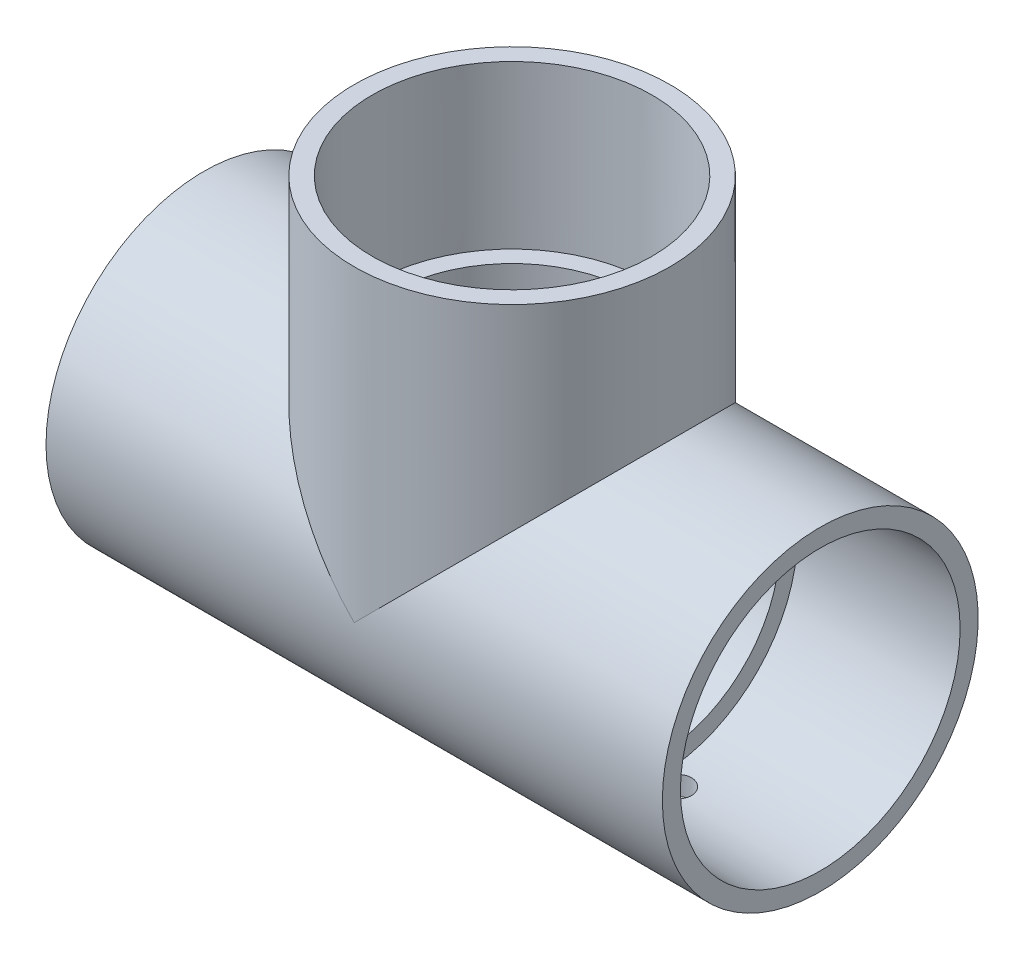
ISO-10303-21;
HEADER;
FILE_DESCRIPTION(('STEP AP214'),'2;1');
FILE_NAME('part.step','',(''),(''),'','','');
FILE_SCHEMA(('AUTOMOTIVE_DESIGN { 1 0 10303 214 1 1 1 1 }'));
ENDSEC;
DATA;
#1=APPLICATION_CONTEXT('core data for automotive mechanical design processes');
#2=APPLICATION_PROTOCOL_DEFINITION('international standard','automotive_design',2000,#1);
#3=PRODUCT_CONTEXT('',#1,'mechanical');
#4=PRODUCT('Part','Part','',(#3));
#5=PRODUCT_RELATED_PRODUCT_CATEGORY('part','',(#4));
#6=PRODUCT_DEFINITION_FORMATION('','',#4);
#7=PRODUCT_DEFINITION_CONTEXT('part definition',#1,'design');
#8=PRODUCT_DEFINITION('design','',#6,#7);
#9=PRODUCT_DEFINITION_SHAPE('','',#8);
#10=(LENGTH_UNIT() NAMED_UNIT(*) SI_UNIT(.MILLI.,.METRE.));
#11=(NAMED_UNIT(*) PLANE_ANGLE_UNIT() SI_UNIT($,.RADIAN.));
#12=(NAMED_UNIT(*) SI_UNIT($,.STERADIAN.) SOLID_ANGLE_UNIT());
#13=UNCERTAINTY_MEASURE_WITH_UNIT(LENGTH_MEASURE(1.E-05),#10,'distance_accuracy_value','');
#14=(GEOMETRIC_REPRESENTATION_CONTEXT(3) GLOBAL_UNCERTAINTY_ASSIGNED_CONTEXT((#13)) GLOBAL_UNIT_ASSIGNED_CONTEXT((#10,
#11,#12)) REPRESENTATION_CONTEXT('',''));
#15=CARTESIAN_POINT('',(0.,0.,0.));
#16=DIRECTION('',(0.,0.,1.));
#17=DIRECTION('',(1.,0.,0.));
#18=AXIS2_PLACEMENT_3D('',#15,#16,#17);
#19=CARTESIAN_POINT('',(-31.75,0.,0.));
#20=DIRECTION('',(1.,0.,0.));
#21=DIRECTION('',(0.,0.,-1.));
#22=AXIS2_PLACEMENT_3D('',#19,#20,#21);
#23=PLANE('',#22);
#24=CARTESIAN_POINT('',(-31.75,0.,0.));
#25=DIRECTION('',(-1.,0.,0.));
#26=DIRECTION('',(0.,0.,1.));
#27=AXIS2_PLACEMENT_3D('',#24,#25,#26);
#28=CIRCLE('',#27,30.0863);
#29=CARTESIAN_POINT('',(-31.75,0.,30.0863));
#30=VERTEX_POINT('',#29);
#31=EDGE_CURVE('E90',#30,#30,#28,.T.);
#32=ORIENTED_EDGE('',*,*,#31,.T.);
#33=EDGE_LOOP('',(#32));
#34=FACE_BOUND('',#33,.T.);
#35=CARTESIAN_POINT('',(-31.75,0.,0.));
#36=DIRECTION('',(1.,0.,0.));
#37=DIRECTION('',(0.,0.,-1.));
#38=AXIS2_PLACEMENT_3D('',#35,#36,#37);
#39=CIRCLE('',#38,26.2509);
#40=CARTESIAN_POINT('',(-31.75,0.,-26.2509));
#41=VERTEX_POINT('',#40);
#42=EDGE_CURVE('E73',#41,#41,#39,.T.);
#43=ORIENTED_EDGE('',*,*,#42,.T.);
#44=EDGE_LOOP('',(#43));
#45=FACE_BOUND('',#44,.T.);
#46=ADVANCED_FACE('F34',(#34,#45),#23,.F.);
#47=CARTESIAN_POINT('',(31.75,0.,0.));
#48=DIRECTION('',(1.,0.,0.));
#49=DIRECTION('',(0.,0.,-1.));
#50=AXIS2_PLACEMENT_3D('',#47,#48,#49);
#51=PLANE('',#50);
#52=CARTESIAN_POINT('',(31.75,0.,0.));
#53=DIRECTION('',(1.,0.,0.));
#54=DIRECTION('',(0.,0.,-1.));
#55=AXIS2_PLACEMENT_3D('',#52,#53,#54);
#56=CIRCLE('',#55,26.2509);
#57=CARTESIAN_POINT('',(31.75,0.,-26.2509));
#58=VERTEX_POINT('',#57);
#59=EDGE_CURVE('E70',#58,#58,#56,.T.);
#60=ORIENTED_EDGE('',*,*,#59,.F.);
#61=EDGE_LOOP('',(#60));
#62=FACE_BOUND('',#61,.T.);
#63=CARTESIAN_POINT('',(31.75,0.,0.));
#64=DIRECTION('',(1.,0.,0.));
#65=DIRECTION('',(0.,0.,-1.));
#66=AXIS2_PLACEMENT_3D('',#63,#64,#65);
#67=CIRCLE('',#66,30.0863);
#68=CARTESIAN_POINT('',(31.75,0.,-30.0863));
#69=VERTEX_POINT('',#68);
#70=EDGE_CURVE('E61',#69,#69,#67,.F.);
#71=ORIENTED_EDGE('',*,*,#70,.F.);
#72=EDGE_LOOP('',(#71));
#73=FACE_BOUND('',#72,.T.);
#74=ADVANCED_FACE('F112',(#62,#73),#51,.T.);
#75=CARTESIAN_POINT('',(31.75,0.,0.));
#76=DIRECTION('',(-1.,0.,0.));
#77=DIRECTION('',(0.,0.,1.));
#78=AXIS2_PLACEMENT_3D('',#75,#76,#77);
#79=CYLINDRICAL_SURFACE('',#78,34.2265);
#80=CARTESIAN_POINT('',(-35.71875,-34.0789183697194,3.175));
#81=CARTESIAN_POINT('',(-35.8966790086813,-34.0789203134602,3.17499226178563));
#82=CARTESIAN_POINT('',(-36.0747272556379,-34.0803268533956,3.15999277025583));
#83=CARTESIAN_POINT('',(-36.4258919059455,-34.085800593893,3.10038084172559));
#84=CARTESIAN_POINT('',(-36.5990025791174,-34.0898707642398,3.05573535043611));
#85=CARTESIAN_POINT('',(-36.9351555521291,-34.1002068447288,2.93813858103536));
#86=CARTESIAN_POINT('',(-37.0982037098493,-34.1064714629199,2.86520395505886));
#87=CARTESIAN_POINT('',(-37.4097069246352,-34.1204889741709,2.69313019596577));
#88=CARTESIAN_POINT('',(-37.558164972372,-34.1282415612616,2.59399644856173));
#89=CARTESIAN_POINT('',(-37.8367780504173,-34.1443888548479,2.3720024396917));
#90=CARTESIAN_POINT('',(-37.9668807359935,-34.1527852963814,2.2490766030941));
#91=CARTESIAN_POINT('',(-38.2046396573217,-34.1692584238434,1.98312742268355));
#92=CARTESIAN_POINT('',(-38.312294887408,-34.1773350954328,1.84010317892453));
#93=CARTESIAN_POINT('',(-38.5022811687253,-34.1922755204198,1.53769983256176));
#94=CARTESIAN_POINT('',(-38.5845663075309,-34.1991370653573,1.37829176687011));
#95=CARTESIAN_POINT('',(-38.7211829431572,-34.2108553208123,1.04784729177191));
#96=CARTESIAN_POINT('',(-38.7755150335566,-34.2157120739007,0.876811129373528));
#97=CARTESIAN_POINT('',(-38.854530899687,-34.2228613639838,0.528491376726568));
#98=CARTESIAN_POINT('',(-38.8793001465034,-34.2251612918561,0.351227329576579));
#99=CARTESIAN_POINT('',(-38.8987515705,-34.2269628904976,-0.00495586949975516));
#100=CARTESIAN_POINT('',(-38.8934344272059,-34.2264646244663,-0.183874983953933));
#101=CARTESIAN_POINT('',(-38.8529336210645,-34.2227320471207,-0.537709551761714));
#102=CARTESIAN_POINT('',(-38.8178418665383,-34.2195061555516,-0.712635626377157));
#103=CARTESIAN_POINT('',(-38.7189310214351,-34.2106906786397,-1.05410437658251));
#104=CARTESIAN_POINT('',(-38.6551116027431,-34.2051010662994,-1.2206469563956));
#105=CARTESIAN_POINT('',(-38.500455497646,-34.1921722743737,-1.54091215219764));
#106=CARTESIAN_POINT('',(-38.4095779165687,-34.1848304499186,-1.69461490904783));
#107=CARTESIAN_POINT('',(-38.2034148594918,-34.1692216208305,-1.98462068072242));
#108=CARTESIAN_POINT('',(-38.088128768288,-34.1609545928807,-2.12092325684515));
#109=CARTESIAN_POINT('',(-37.8359038391626,-34.1443869544718,-2.37279742913586));
#110=CARTESIAN_POINT('',(-37.6988850899773,-34.1360863347932,-2.48828901709497));
#111=CARTESIAN_POINT('',(-37.4073620145601,-34.1204182222573,-2.69464400224354));
#112=CARTESIAN_POINT('',(-37.2528576683969,-34.1130507304637,-2.78550737135963));
#113=CARTESIAN_POINT('',(-36.9306901466803,-34.1000820784954,-2.94002504037609));
#114=CARTESIAN_POINT('',(-36.7630247609934,-34.0944812157867,-3.0036747586683));
#115=CARTESIAN_POINT('',(-36.4193233101328,-34.0856860166383,-3.10189689423914));
#116=CARTESIAN_POINT('',(-36.2432874638907,-34.0824916172938,-3.13647007158082));
#117=CARTESIAN_POINT('',(-35.8885434487875,-34.078881637116,-3.17545554760568));
#118=CARTESIAN_POINT('',(-35.7098476633452,-34.0784557589082,-3.17997961380772));
#119=CARTESIAN_POINT('',(-35.3542404079067,-34.0804038671608,-3.15903162860874));
#120=CARTESIAN_POINT('',(-35.1773289172417,-34.0827778211506,-3.13355992507777));
#121=CARTESIAN_POINT('',(-34.8306356574122,-34.090048733911,-3.05343680720142));
#122=CARTESIAN_POINT('',(-34.6608416440012,-34.0949411498422,-2.9988379264714));
#123=CARTESIAN_POINT('',(-34.3328231650031,-34.1066940173597,-2.86206384367578));
#124=CARTESIAN_POINT('',(-34.1745989284989,-34.1135545079009,-2.77988809576535));
#125=CARTESIAN_POINT('',(-33.8737010467485,-34.1284954716549,-2.59001166723584));
#126=CARTESIAN_POINT('',(-33.7310744355369,-34.1365794685716,-2.48223673312538));
#127=CARTESIAN_POINT('',(-33.4658966805726,-34.1530448841537,-2.24432806437227));
#128=CARTESIAN_POINT('',(-33.3433459645595,-34.1614263091516,-2.11419385346113));
#129=CARTESIAN_POINT('',(-33.1214151264204,-34.1775731049198,-1.83477665006231));
#130=CARTESIAN_POINT('',(-33.0221077827434,-34.1853364917437,-1.68543572179717));
#131=CARTESIAN_POINT('',(-32.8499828062403,-34.1993437438446,-1.37213162624264));
#132=CARTESIAN_POINT('',(-32.7771648548417,-34.2055876273955,-1.20816863483392));
#133=CARTESIAN_POINT('',(-32.6602097777702,-34.2158433243765,-0.870531837804841));
#134=CARTESIAN_POINT('',(-32.6160282176807,-34.2198585944959,-0.696873533208768));
#135=CARTESIAN_POINT('',(-32.5574549608791,-34.2252187722616,-0.344564540224374));
#136=CARTESIAN_POINT('',(-32.5430625518476,-34.2265637437601,-0.165913971314794));
#137=CARTESIAN_POINT('',(-32.5444853680036,-34.226431810902,0.1905923234205));
#138=CARTESIAN_POINT('',(-32.5601874129636,-34.2249654793807,0.368448515748957));
#139=CARTESIAN_POINT('',(-32.6211166794046,-34.2193965691915,0.718985512288312));
#140=CARTESIAN_POINT('',(-32.6663439324021,-34.2152939877096,0.891666310974522));
#141=CARTESIAN_POINT('',(-32.7850095680959,-34.2049125225669,1.22695354321367));
#142=CARTESIAN_POINT('',(-32.8584452052946,-34.1986338507089,1.38956095541249));
#143=CARTESIAN_POINT('',(-33.0314306522116,-34.1846012485521,1.70015850978309));
#144=CARTESIAN_POINT('',(-33.1309801910983,-34.1768473335533,1.84814880352955));
#145=CARTESIAN_POINT('',(-33.3537925526985,-34.1606988351698,2.12589109854083));
#146=CARTESIAN_POINT('',(-33.4771394870733,-34.152302045005,2.2555754954564));
#147=CARTESIAN_POINT('',(-33.7438844526458,-34.1358329375056,2.49245879598915));
#148=CARTESIAN_POINT('',(-33.8872873078343,-34.1277606988377,2.59965227437808));
#149=CARTESIAN_POINT('',(-34.1904166913552,-34.1128352696252,2.7886935800386));
#150=CARTESIAN_POINT('',(-34.3501789642899,-34.1059848421769,2.87048426133794));
#151=CARTESIAN_POINT('',(-34.6811278198221,-34.0943118935123,3.00597167121951));
#152=CARTESIAN_POINT('',(-34.8523011513214,-34.0894870660131,3.0597003673856));
#153=CARTESIAN_POINT('',(-35.1401771475287,-34.0836393883608,3.12400956811009));
#154=CARTESIAN_POINT('',(-35.2550341566999,-34.0818772713351,3.14310517546228));
#155=CARTESIAN_POINT('',(-35.486160460393,-34.0795161286833,3.16860289872299));
#156=CARTESIAN_POINT('',(-35.6024297499969,-34.078917099008,3.17500505882114));
#157=CARTESIAN_POINT('',(-35.71875,-34.0789183697194,3.175));
#158=B_SPLINE_CURVE_WITH_KNOTS('',3,(#80,#81,#82,#83,#84,#85,#86,#87,#88,#89,#90,#91,#92,#93,
#94,#95,#96,#97,#98,#99,#100,#101,#102,#103,#104,#105,#106,#107,#108,#109,#110,#111,#112,#113,
#114,#115,#116,#117,#118,#119,#120,#121,#122,#123,#124,#125,#126,#127,#128,#129,#130,#131,#132,
#133,#134,#135,#136,#137,#138,#139,#140,#141,#142,#143,#144,#145,#146,#147,#148,#149,#150,#151,
#152,#153,#154,#155,#156,#157),.UNSPECIFIED.,.T.,.F.,(4,2,2,2,2,2,2,2,2,2,2,2,2,2,2,2,2,2,2,2,2,
2,2,2,2,2,2,2,2,2,2,2,2,2,2,2,2,2,4),(0.,0.533362279350525,1.06732024040564,1.60096436793671,
2.13449888029093,2.66952540353088,3.20457589128355,3.74058905581068,4.27659083771116,
4.81103916635393,5.34547542409362,5.878267959722,6.41106658083157,6.94467457661669,
7.47829602332592,8.01392714216824,8.54955887156663,9.08528074283214,9.62098860985077,
10.1547027928859,10.6884107863364,11.2211594253384,11.7539186099635,12.2882424149077,
12.8225776027401,13.3585641361275,13.8945442233007,14.4296906390103,14.9648242581314,
15.4979492773302,16.031074865615,16.5641485783918,17.0972167627905,17.6322047808242,
18.1673216999394,18.7036338384048,19.2393336821685,19.5880179699057,19.936701043768),.UNSPECIFIED.);
#159=CARTESIAN_POINT('',(-35.71875,-34.0789183697194,3.175));
#160=VERTEX_POINT('',#159);
#161=EDGE_CURVE('E178',#160,#160,#158,.T.);
#162=ORIENTED_EDGE('',*,*,#161,.F.);
#163=EDGE_LOOP('',(#162));
#164=FACE_BOUND('',#163,.T.);
#165=CARTESIAN_POINT('',(35.71875,-34.0789183697194,3.175));
#166=CARTESIAN_POINT('',(35.5408209913187,-34.0789203134602,3.17499226178563));
#167=CARTESIAN_POINT('',(35.3627727443621,-34.0803268533956,3.15999277025583));
#168=CARTESIAN_POINT('',(35.0116080940545,-34.085800593893,3.10038084172559));
#169=CARTESIAN_POINT('',(34.8384974208826,-34.0898707642398,3.05573535043611));
#170=CARTESIAN_POINT('',(34.5023444478709,-34.1002068447288,2.93813858103536));
#171=CARTESIAN_POINT('',(34.3392962901507,-34.1064714629199,2.86520395505886));
#172=CARTESIAN_POINT('',(34.0277930753648,-34.1204889741709,2.69313019596577));
#173=CARTESIAN_POINT('',(33.879335027628,-34.1282415612616,2.59399644856173));
#174=CARTESIAN_POINT('',(33.6007219495827,-34.1443888548479,2.3720024396917));
#175=CARTESIAN_POINT('',(33.4706192640065,-34.1527852963814,2.2490766030941));
#176=CARTESIAN_POINT('',(33.2328603426783,-34.1692584238434,1.98312742268355));
#177=CARTESIAN_POINT('',(33.125205112592,-34.1773350954328,1.84010317892453));
#178=CARTESIAN_POINT('',(32.9352188312747,-34.1922755204198,1.53769983256176));
#179=CARTESIAN_POINT('',(32.8529336924691,-34.1991370653573,1.37829176687011));
#180=CARTESIAN_POINT('',(32.7163170568428,-34.2108553208123,1.04784729177191));
#181=CARTESIAN_POINT('',(32.6619849664434,-34.2157120739007,0.876811129373528));
#182=CARTESIAN_POINT('',(32.582969100313,-34.2228613639838,0.528491376726568));
#183=CARTESIAN_POINT('',(32.5581998534966,-34.2251612918561,0.351227329576579));
#184=CARTESIAN_POINT('',(32.5387484295,-34.2269628904976,-0.00495586949975516));
#185=CARTESIAN_POINT('',(32.5440655727941,-34.2264646244663,-0.183874983953933));
#186=CARTESIAN_POINT('',(32.5845663789355,-34.2227320471207,-0.537709551761714));
#187=CARTESIAN_POINT('',(32.6196581334617,-34.2195061555516,-0.712635626377157));
#188=CARTESIAN_POINT('',(32.7185689785649,-34.2106906786397,-1.05410437658251));
#189=CARTESIAN_POINT('',(32.7823883972569,-34.2051010662994,-1.2206469563956));
#190=CARTESIAN_POINT('',(32.937044502354,-34.1921722743737,-1.54091215219764));
#191=CARTESIAN_POINT('',(33.0279220834314,-34.1848304499186,-1.69461490904783));
#192=CARTESIAN_POINT('',(33.2340851405082,-34.1692216208305,-1.98462068072242));
#193=CARTESIAN_POINT('',(33.349371231712,-34.1609545928807,-2.12092325684515));
#194=CARTESIAN_POINT('',(33.6015961608374,-34.1443869544718,-2.37279742913587));
#195=CARTESIAN_POINT('',(33.7386149100227,-34.1360863347932,-2.48828901709498));
#196=CARTESIAN_POINT('',(34.0301379854399,-34.1204182222573,-2.69464400224355));
#197=CARTESIAN_POINT('',(34.1846423316031,-34.1130507304637,-2.78550737135963));
#198=CARTESIAN_POINT('',(34.5068098533197,-34.1000820784954,-2.94002504037609));
#199=CARTESIAN_POINT('',(34.6744752390066,-34.0944812157867,-3.0036747586683));
#200=CARTESIAN_POINT('',(35.0181766898672,-34.0856860166383,-3.10189689423914));
#201=CARTESIAN_POINT('',(35.1942125361093,-34.0824916172938,-3.13647007158082));
#202=CARTESIAN_POINT('',(35.5489565512125,-34.078881637116,-3.17545554760568));
#203=CARTESIAN_POINT('',(35.7276523366548,-34.0784557589082,-3.17997961380772));
#204=CARTESIAN_POINT('',(36.0832595920933,-34.0804038671608,-3.15903162860874));
#205=CARTESIAN_POINT('',(36.2601710827583,-34.0827778211506,-3.13355992507777));
#206=CARTESIAN_POINT('',(36.6068643425878,-34.090048733911,-3.05343680720142));
#207=CARTESIAN_POINT('',(36.7766583559989,-34.0949411498422,-2.9988379264714));
#208=CARTESIAN_POINT('',(37.1046768349969,-34.1066940173597,-2.86206384367578));
#209=CARTESIAN_POINT('',(37.2629010715011,-34.1135545079009,-2.77988809576535));
#210=CARTESIAN_POINT('',(37.5637989532515,-34.1284954716549,-2.59001166723584));
#211=CARTESIAN_POINT('',(37.7064255644631,-34.1365794685716,-2.48223673312538));
#212=CARTESIAN_POINT('',(37.9716033194274,-34.1530448841537,-2.24432806437227));
#213=CARTESIAN_POINT('',(38.0941540354405,-34.1614263091516,-2.11419385346113));
#214=CARTESIAN_POINT('',(38.3160848735796,-34.1775731049198,-1.83477665006231));
#215=CARTESIAN_POINT('',(38.4153922172566,-34.1853364917437,-1.68543572179717));
#216=CARTESIAN_POINT('',(38.5875171937597,-34.1993437438446,-1.37213162624264));
#217=CARTESIAN_POINT('',(38.6603351451583,-34.2055876273955,-1.20816863483392));
#218=CARTESIAN_POINT('',(38.7772902222298,-34.2158433243765,-0.870531837804841));
#219=CARTESIAN_POINT('',(38.8214717823193,-34.2198585944959,-0.696873533208768));
#220=CARTESIAN_POINT('',(38.8800450391209,-34.2252187722616,-0.344564540224374));
#221=CARTESIAN_POINT('',(38.8944374481524,-34.2265637437601,-0.165913971314794));
#222=CARTESIAN_POINT('',(38.8930146319964,-34.226431810902,0.1905923234205));
#223=CARTESIAN_POINT('',(38.8773125870364,-34.2249654793807,0.368448515748957));
#224=CARTESIAN_POINT('',(38.8163833205954,-34.2193965691915,0.718985512288312));
#225=CARTESIAN_POINT('',(38.7711560675979,-34.2152939877096,0.891666310974522));
#226=CARTESIAN_POINT('',(38.6524904319041,-34.2049125225669,1.22695354321367));
#227=CARTESIAN_POINT('',(38.5790547947054,-34.1986338507089,1.38956095541249));
#228=CARTESIAN_POINT('',(38.4060693477884,-34.1846012485521,1.70015850978309));
#229=CARTESIAN_POINT('',(38.3065198089017,-34.1768473335533,1.84814880352955));
#230=CARTESIAN_POINT('',(38.0837074473015,-34.1606988351698,2.12589109854083));
#231=CARTESIAN_POINT('',(37.9603605129267,-34.152302045005,2.2555754954564));
#232=CARTESIAN_POINT('',(37.6936155473542,-34.1358329375056,2.49245879598915));
#233=CARTESIAN_POINT('',(37.5502126921657,-34.1277606988377,2.59965227437808));
#234=CARTESIAN_POINT('',(37.2470833086448,-34.1128352696252,2.7886935800386));
#235=CARTESIAN_POINT('',(37.0873210357101,-34.1059848421769,2.87048426133794));
#236=CARTESIAN_POINT('',(36.7563721801779,-34.0943118935123,3.00597167121951));
#237=CARTESIAN_POINT('',(36.5851988486786,-34.0894870660131,3.0597003673856));
#238=CARTESIAN_POINT('',(36.2973228524713,-34.0836393883608,3.12400956811009));
#239=CARTESIAN_POINT('',(36.1824658433001,-34.0818772713351,3.14310517546228));
#240=CARTESIAN_POINT('',(35.951339539607,-34.0795161286833,3.16860289872299));
#241=CARTESIAN_POINT('',(35.8350702500031,-34.078917099008,3.17500505882114));
#242=CARTESIAN_POINT('',(35.71875,-34.0789183697194,3.175));
#243=B_SPLINE_CURVE_WITH_KNOTS('',3,(#165,#166,#167,#168,#169,#170,#171,#172,#173,#174,#175,
#176,#177,#178,#179,#180,#181,#182,#183,#184,#185,#186,#187,#188,#189,#190,#191,#192,#193,#194,
#195,#196,#197,#198,#199,#200,#201,#202,#203,#204,#205,#206,#207,#208,#209,#210,#211,#212,#213,
#214,#215,#216,#217,#218,#219,#220,#221,#222,#223,#224,#225,#226,#227,#228,#229,#230,#231,#232,
#233,#234,#235,#236,#237,#238,#239,#240,#241,#242),.UNSPECIFIED.,.T.,.F.,(4,2,2,2,2,2,2,2,2,2,2,
2,2,2,2,2,2,2,2,2,2,2,2,2,2,2,2,2,2,2,2,2,2,2,2,2,2,2,4),(0.,0.533362279350525,1.06732024040564,
1.60096436793671,2.13449888029093,2.66952540353088,3.20457589128355,3.74058905581068,
4.27659083771116,4.81103916635393,5.34547542409362,5.878267959722,6.41106658083157,
6.94467457661669,7.47829602332592,8.01392714216825,8.54955887156663,9.08528074283214,
9.62098860985077,10.1547027928859,10.6884107863364,11.2211594253385,11.7539186099635,
12.2882424149077,12.8225776027401,13.3585641361275,13.8945442233007,14.4296906390103,
14.9648242581314,15.4979492773302,16.031074865615,16.5641485783918,17.0972167627905,
17.6322047808242,18.1673216999394,18.7036338384048,19.2393336821685,19.5880179699057,
19.936701043768),.UNSPECIFIED.);
#244=CARTESIAN_POINT('',(35.71875,-34.0789183697194,3.175));
#245=VERTEX_POINT('',#244);
#246=EDGE_CURVE('E207',#245,#245,#243,.T.);
#247=ORIENTED_EDGE('',*,*,#246,.F.);
#248=EDGE_LOOP('',(#247));
#249=FACE_BOUND('',#248,.T.);
#250=CARTESIAN_POINT('',(-66.802,0.,0.));
#251=DIRECTION('',(-1.,0.,0.));
#252=DIRECTION('',(0.,0.,1.));
#253=AXIS2_PLACEMENT_3D('',#250,#251,#252);
#254=CIRCLE('',#253,34.2265);
#255=CARTESIAN_POINT('',(-66.802,0.,34.2265));
#256=VERTEX_POINT('',#255);
#257=EDGE_CURVE('E87',#256,#256,#254,.T.);
#258=ORIENTED_EDGE('',*,*,#257,.F.);
#259=EDGE_LOOP('',(#258));
#260=FACE_BOUND('',#259,.T.);
#261=CARTESIAN_POINT('',(66.802,0.,0.));
#262=DIRECTION('',(-1.,0.,0.));
#263=DIRECTION('',(0.,0.,1.));
#264=AXIS2_PLACEMENT_3D('',#261,#262,#263);
#265=CIRCLE('',#264,34.2265);
#266=CARTESIAN_POINT('',(66.802,0.,34.2265));
#267=VERTEX_POINT('',#266);
#268=EDGE_CURVE('E75',#267,#267,#265,.T.);
#269=ORIENTED_EDGE('',*,*,#268,.T.);
#270=EDGE_LOOP('',(#269));
#271=FACE_BOUND('',#270,.T.);
#272=CARTESIAN_POINT('',(0.,0.,0.));
#273=DIRECTION('',(-0.707106781186547,-0.707106781186547,0.));
#274=DIRECTION('',(0.707106781186547,-0.707106781186547,0.));
#275=AXIS2_PLACEMENT_3D('',#272,#273,#274);
#276=ELLIPSE('',#275,48.4035804925627,34.2265);
#277=CARTESIAN_POINT('',(0.,0.,34.2265));
#278=VERTEX_POINT('',#277);
#279=CARTESIAN_POINT('',(0.,0.,-34.2265));
#280=VERTEX_POINT('',#279);
#281=EDGE_CURVE('E96',#278,#280,#276,.T.);
#282=ORIENTED_EDGE('',*,*,#281,.T.);
#283=CARTESIAN_POINT('',(0.,0.,0.));
#284=DIRECTION('',(0.707106781186547,-0.707106781186547,0.));
#285=DIRECTION('',(-0.707106781186547,-0.707106781186547,0.));
#286=AXIS2_PLACEMENT_3D('',#283,#284,#285);
#287=ELLIPSE('',#286,48.4035804925627,34.2265);
#288=EDGE_CURVE('E53',#280,#278,#287,.T.);
#289=ORIENTED_EDGE('',*,*,#288,.T.);
#290=EDGE_LOOP('',(#282,#289));
#291=FACE_BOUND('',#290,.T.);
#292=ADVANCED_FACE('F114',(#164,#249,#260,#271,#291),#79,.T.);
#293=CARTESIAN_POINT('',(-31.75,0.,0.));
#294=DIRECTION('',(-1.,0.,0.));
#295=DIRECTION('',(0.,0.,1.));
#296=AXIS2_PLACEMENT_3D('',#293,#294,#295);
#297=CONICAL_SURFACE('',#296,30.0863,0.00652164666957405);
#298=CARTESIAN_POINT('',(-37.9444345988289,-30.0414881227744,-2.26427760368259));
#299=CARTESIAN_POINT('',(-37.8173063819571,-30.0312389414365,-2.38922878881212));
#300=CARTESIAN_POINT('',(-37.6795517219933,-30.020936748572,-2.50353051949117));
#301=CARTESIAN_POINT('',(-37.386661577783,-30.0013124537562,-2.70750967325692));
#302=CARTESIAN_POINT('',(-37.23150746937,-29.9919914231147,-2.7971603490377));
#303=CARTESIAN_POINT('',(-36.908281660893,-29.9753098096672,-2.94915442349602));
#304=CARTESIAN_POINT('',(-36.7402130258119,-29.9679487635416,-3.01150427804656));
#305=CARTESIAN_POINT('',(-36.3959412846637,-29.955933776945,-3.10707999726918));
#306=CARTESIAN_POINT('',(-36.2197402542683,-29.9512791497805,-3.14031325071548));
#307=CARTESIAN_POINT('',(-35.8648525142479,-29.9451218881733,-3.17662994849027));
#308=CARTESIAN_POINT('',(-35.6861772074452,-29.9436078253098,-3.17982285931387));
#309=CARTESIAN_POINT('',(-35.3308131633964,-29.943772377808,-3.15623835028586));
#310=CARTESIAN_POINT('',(-35.1541244670486,-29.9454510587779,-3.12946031456093));
#311=CARTESIAN_POINT('',(-34.808268077268,-29.9517031503121,-3.04682969136362));
#312=CARTESIAN_POINT('',(-34.6390805741437,-29.9562683819133,-2.99105933199367));
#313=CARTESIAN_POINT('',(-34.3124530160009,-29.9676773700915,-2.85209657976722));
#314=CARTESIAN_POINT('',(-34.1550132018237,-29.9745211733661,-2.76890362490507));
#315=CARTESIAN_POINT('',(-33.8557654290795,-29.9896590074451,-2.5771305143606));
#316=CARTESIAN_POINT('',(-33.7140120207116,-29.9979578547575,-2.46846562546386));
#317=CARTESIAN_POINT('',(-33.4507020492372,-30.0149811592117,-2.22895924312467));
#318=CARTESIAN_POINT('',(-33.329145984147,-30.0237056268414,-2.09811720300933));
#319=CARTESIAN_POINT('',(-33.1091929828611,-30.0405720535417,-1.81735077049891));
#320=CARTESIAN_POINT('',(-33.0108897799484,-30.0487115659058,-1.66735277632188));
#321=CARTESIAN_POINT('',(-32.8408666141274,-30.0633991703318,-1.35290687624186));
#322=CARTESIAN_POINT('',(-32.7691463618336,-30.0699472797177,-1.18845912766493));
#323=CARTESIAN_POINT('',(-32.6544515334073,-30.0806655332454,-0.850040702241644));
#324=CARTESIAN_POINT('',(-32.61143179696,-30.0848394117113,-0.676085454398508));
#325=CARTESIAN_POINT('',(-32.5552172556232,-30.0903304400407,-0.323378599682013));
#326=CARTESIAN_POINT('',(-32.5420215617912,-30.0916476750499,-0.144627135926485));
#327=CARTESIAN_POINT('',(-32.5458334794349,-30.0912704411909,0.211779754220987));
#328=CARTESIAN_POINT('',(-32.5627117353207,-30.0895888709089,0.389436592471255));
#329=CARTESIAN_POINT('',(-32.6259261399869,-30.0834369315292,0.739377894762452));
#330=CARTESIAN_POINT('',(-32.6722623168529,-30.0789665597727,0.911662353681114));
#331=CARTESIAN_POINT('',(-32.7930494150311,-30.0677622150905,1.24599083674318));
#332=CARTESIAN_POINT('',(-32.8674999488251,-30.0610282733652,1.40803500199918));
#333=CARTESIAN_POINT('',(-33.0423939743841,-30.0460877452166,1.71735634308846));
#334=CARTESIAN_POINT('',(-33.142838232376,-30.0378811153845,1.8646330834391));
#335=CARTESIAN_POINT('',(-33.3673812445914,-30.0209264856895,2.14091397297746));
#336=CARTESIAN_POINT('',(-33.4915795365414,-30.012176316275,2.26983710065605));
#337=CARTESIAN_POINT('',(-33.7598655238373,-29.995217432281,2.50503923726957));
#338=CARTESIAN_POINT('',(-33.9039534479594,-29.9870087239311,2.61131798570656));
#339=CARTESIAN_POINT('',(-34.2082307798016,-29.9721260220696,2.7983747130613));
#340=CARTESIAN_POINT('',(-34.3684461552822,-29.9654545624595,2.87911066943867));
#341=CARTESIAN_POINT('',(-34.7002418802939,-29.9545130642194,3.01251303522274));
#342=CARTESIAN_POINT('',(-34.8718219035864,-29.9502429566885,3.06518024999101));
#343=CARTESIAN_POINT('',(-35.220754592988,-29.9447001316802,3.14075894276643));
#344=CARTESIAN_POINT('',(-35.3980818843187,-29.9434156844915,3.16378670498271));
#345=CARTESIAN_POINT('',(-35.7540795453129,-29.9440544147707,3.17979918158964));
#346=CARTESIAN_POINT('',(-35.9327498841696,-29.9459775188859,3.17278458300533));
#347=CARTESIAN_POINT('',(-36.2857254812225,-29.9528975006418,3.12900705370817));
#348=CARTESIAN_POINT('',(-36.4600435014339,-29.9578839187702,3.09234521763235));
#349=CARTESIAN_POINT('',(-36.8000293691654,-29.970451659043,2.99047716440553));
#350=CARTESIAN_POINT('',(-36.9656970612991,-29.9780330277822,2.92527043469803));
#351=CARTESIAN_POINT('',(-37.2841994534262,-29.9950521309968,2.76796468169097));
#352=CARTESIAN_POINT('',(-37.4369972007113,-30.0044949671344,2.67579140823244));
#353=CARTESIAN_POINT('',(-37.7249978229029,-30.0242479146615,2.46722685143124));
#354=CARTESIAN_POINT('',(-37.8602000699374,-30.034558056978,2.35083470425528));
#355=CARTESIAN_POINT('',(-38.1098754092064,-30.0550201404246,2.09644089960336));
#356=CARTESIAN_POINT('',(-38.2242417961228,-30.0651710365861,1.95833440120179));
#357=CARTESIAN_POINT('',(-38.4281754591728,-30.0841832125643,1.66480484818183));
#358=CARTESIAN_POINT('',(-38.5177427625731,-30.0930444937989,1.50938181260331));
#359=CARTESIAN_POINT('',(-38.6694708110877,-30.1085253490986,1.18566806240176));
#360=CARTESIAN_POINT('',(-38.7316441338879,-30.1151459516256,1.01738329485686));
#361=CARTESIAN_POINT('',(-38.8268191740076,-30.1254368339986,0.672678296902757));
#362=CARTESIAN_POINT('',(-38.8598229993846,-30.129107327045,0.496258655364468));
#363=CARTESIAN_POINT('',(-38.8955862322907,-30.1330898764688,0.141333608642378));
#364=CARTESIAN_POINT('',(-38.8985122483295,-30.1334204334135,-0.0371548176977409));
#365=CARTESIAN_POINT('',(-38.8744611108811,-30.1307352817584,-0.392120518135101));
#366=CARTESIAN_POINT('',(-38.8474778318821,-30.127718887693,-0.568597372776979));
#367=CARTESIAN_POINT('',(-38.7644875162779,-30.1186727097293,-0.914129076831838));
#368=CARTESIAN_POINT('',(-38.7085361904318,-30.112648710786,-1.08319749945585));
#369=CARTESIAN_POINT('',(-38.5692880851596,-30.0982341554243,-1.40941407272195));
#370=CARTESIAN_POINT('',(-38.4860198028711,-30.0898460665115,-1.5665744364657));
#371=CARTESIAN_POINT('',(-38.326507843611,-30.0746383708948,-1.81499641571877));
#372=CARTESIAN_POINT('',(-38.2571512280412,-30.0682260023511,-1.91078078570211));
#373=CARTESIAN_POINT('',(-38.1082295933213,-30.0550462218826,-2.09402765047196));
#374=CARTESIAN_POINT('',(-38.0286645161054,-30.0482788079384,-2.1814900979184));
#375=CARTESIAN_POINT('',(-37.9444345988289,-30.0414881227744,-2.26427760368259));
#376=B_SPLINE_CURVE_WITH_KNOTS('',3,(#298,#299,#300,#301,#302,#303,#304,#305,#306,#307,#308,
#309,#310,#311,#312,#313,#314,#315,#316,#317,#318,#319,#320,#321,#322,#323,#324,#325,#326,#327,
#328,#329,#330,#331,#332,#333,#334,#335,#336,#337,#338,#339,#340,#341,#342,#343,#344,#345,#346,
#347,#348,#349,#350,#351,#352,#353,#354,#355,#356,#357,#358,#359,#360,#361,#362,#363,#364,#365,
#366,#367,#368,#369,#370,#371,#372,#373,#374,#375),.UNSPECIFIED.,.T.,.F.,(4,2,2,2,2,2,2,2,2,2,2,
2,2,2,2,2,2,2,2,2,2,2,2,2,2,2,2,2,2,2,2,2,2,2,2,2,2,2,4),(0.,0.535215926585501,1.07101031099691,
1.60667792665687,2.14220956922061,2.67578898445345,3.209379364417,3.74146456458646,
4.27356067012342,4.8074525792562,5.34135765088617,5.87737957482766,6.4133956633919,
6.9485663277838,7.48372104054348,8.01657947246051,8.54943841241316,9.08229000789755,
9.61515731224215,10.1503084787537,10.6854658012412,11.2214990308897,11.7575168795918,
12.2914252990069,12.825321508779,13.3574048148217,13.8894976754258,14.4230696243467,
14.9566606078541,15.4929118004239,16.0291624033805,16.5651665347407,17.1011319263197,
17.6341268610529,18.1672309748945,18.6993136213105,19.2308429531392,19.5854529516014,
19.9400649671766),.UNSPECIFIED.);
#377=CARTESIAN_POINT('',(-37.9444345988289,-30.0414881227744,-2.26427760368259));
#378=VERTEX_POINT('',#377);
#379=EDGE_CURVE('E172',#378,#378,#376,.T.);
#380=ORIENTED_EDGE('',*,*,#379,.T.);
#381=EDGE_LOOP('',(#380));
#382=FACE_BOUND('',#381,.T.);
#383=CARTESIAN_POINT('',(-66.802,0.,0.));
#384=DIRECTION('',(-1.,0.,0.));
#385=DIRECTION('',(0.,0.,1.));
#386=AXIS2_PLACEMENT_3D('',#383,#384,#385);
#387=CIRCLE('',#386,30.3149);
#388=CARTESIAN_POINT('',(-66.802,0.,30.3149));
#389=VERTEX_POINT('',#388);
#390=EDGE_CURVE('E93',#389,#389,#387,.T.);
#391=ORIENTED_EDGE('',*,*,#390,.T.);
#392=EDGE_LOOP('',(#391));
#393=FACE_BOUND('',#392,.T.);
#394=ORIENTED_EDGE('',*,*,#31,.F.);
#395=EDGE_LOOP('',(#394));
#396=FACE_BOUND('',#395,.T.);
#397=ADVANCED_FACE('F122',(#382,#393,#396),#297,.F.);
#398=CARTESIAN_POINT('',(66.802,0.,0.));
#399=DIRECTION('',(1.,0.,0.));
#400=DIRECTION('',(0.,0.,-1.));
#401=AXIS2_PLACEMENT_3D('',#398,#399,#400);
#402=CONICAL_SURFACE('',#401,30.3149,0.00652164666957375);
#403=CARTESIAN_POINT('',(33.4882498480459,-30.0127010367273,-2.25953403872026));
#404=CARTESIAN_POINT('',(33.6150191380387,-30.0041096436701,-2.38466414823673));
#405=CARTESIAN_POINT('',(33.7524266766524,-29.9955987349671,-2.4991872779438));
#406=CARTESIAN_POINT('',(34.0446525808352,-29.9797740870752,-2.70368086548887));
#407=CARTESIAN_POINT('',(34.1994894249783,-29.9724616390498,-2.79362491171289));
#408=CARTESIAN_POINT('',(34.5221098549532,-29.9599568966743,-2.94626910188531));
#409=CARTESIAN_POINT('',(34.689890332953,-29.9547640952587,-3.00897576184108));
#410=CARTESIAN_POINT('',(35.0336140599603,-29.9471832750061,-3.10532870059315));
#411=CARTESIAN_POINT('',(35.209555264105,-29.9447945574444,-3.13898221833142));
#412=CARTESIAN_POINT('',(35.5640000160585,-29.9431932675566,-3.17621198176765));
#413=CARTESIAN_POINT('',(35.7424928024528,-29.9439699108671,-3.17989022473973));
#414=CARTESIAN_POINT('',(36.0975403142113,-29.9486844015094,-3.15733843533209));
#415=CARTESIAN_POINT('',(36.2740949876324,-29.9526223333578,-3.13110760333012));
#416=CARTESIAN_POINT('',(36.6199625068414,-29.9632989557273,-3.0495833244805));
#417=CARTESIAN_POINT('',(36.7892867340796,-29.9700330509786,-2.99433752213274));
#418=CARTESIAN_POINT('',(37.1162593114312,-29.9856342727271,-2.8564101837052));
#419=CARTESIAN_POINT('',(37.2739073450121,-29.994501457023,-2.77372790417706));
#420=CARTESIAN_POINT('',(37.5738055772688,-30.0135037188668,-2.58285201425619));
#421=CARTESIAN_POINT('',(37.7159855730293,-30.0236441609446,-2.4745486405013));
#422=CARTESIAN_POINT('',(37.9801957659775,-30.0441032504107,-2.23566719880729));
#423=CARTESIAN_POINT('',(38.102225453842,-30.0544219022961,-2.10508856800381));
#424=CARTESIAN_POINT('',(38.3231459806405,-30.0741891291901,-1.82475099752693));
#425=CARTESIAN_POINT('',(38.421945791429,-30.0836341961388,-1.67492004742987));
#426=CARTESIAN_POINT('',(38.5929711712952,-30.1005992647029,-1.36068862695135));
#427=CARTESIAN_POINT('',(38.6651972013914,-30.1081192997143,-1.19628840938808));
#428=CARTESIAN_POINT('',(38.7808174900204,-30.1204078370139,-0.85803664690974));
#429=CARTESIAN_POINT('',(38.8242884745136,-30.1251836570694,-0.684211603465603));
#430=CARTESIAN_POINT('',(38.8814229983425,-30.1314993233975,-0.331674675476331));
#431=CARTESIAN_POINT('',(38.8950876443347,-30.1330392898116,-0.152962972613638));
#432=CARTESIAN_POINT('',(38.8922133060818,-30.132717786764,0.20325008078437));
#433=CARTESIAN_POINT('',(38.8758361577718,-30.1308745427142,0.380752776559229));
#434=CARTESIAN_POINT('',(38.8136786878608,-30.1240200860471,0.730467440136464));
#435=CARTESIAN_POINT('',(38.7678983814412,-30.1190088750656,0.902679410670503));
#436=CARTESIAN_POINT('',(38.6482744583905,-30.1063537560378,1.23693996534382));
#437=CARTESIAN_POINT('',(38.5744330474369,-30.0987100549167,1.39898934712361));
#438=CARTESIAN_POINT('',(38.4007987047525,-30.0815994936446,1.70842550142378));
#439=CARTESIAN_POINT('',(38.3010048674737,-30.0721325698797,1.85581176206131));
#440=CARTESIAN_POINT('',(38.0776724789568,-30.052317844347,2.13257980788897));
#441=CARTESIAN_POINT('',(37.9540103264768,-30.0419656206762,2.26186154833972));
#442=CARTESIAN_POINT('',(37.6867500284859,-30.0215154211437,2.49787609027437));
#443=CARTESIAN_POINT('',(37.5431514887307,-30.0114174503145,2.6046084457364));
#444=CARTESIAN_POINT('',(37.2395893584527,-29.9925050344686,2.79278573332529));
#445=CARTESIAN_POINT('',(37.0795800915944,-29.9836943469776,2.87415739229994));
#446=CARTESIAN_POINT('',(36.7480592899687,-29.9683059924234,3.00884640991009));
#447=CARTESIAN_POINT('',(36.5765480564799,-29.9617282668982,3.0621645030476));
#448=CARTESIAN_POINT('',(36.2275631023974,-29.9514841565642,3.13903492799955));
#449=CARTESIAN_POINT('',(36.0501138803656,-29.9478070544776,3.16269702606909));
#450=CARTESIAN_POINT('',(35.6937259707488,-29.9436471410764,3.17990937002158));
#451=CARTESIAN_POINT('',(35.514787326602,-29.9431642369291,3.17346049102585));
#452=CARTESIAN_POINT('',(35.1613410524473,-29.9453440383729,3.13072969244443));
#453=CARTESIAN_POINT('',(34.9868172481737,-29.9479927559115,3.09458065427957));
#454=CARTESIAN_POINT('',(34.6463164220873,-29.9560161236959,2.99366721749163));
#455=CARTESIAN_POINT('',(34.480339484739,-29.9613908008754,2.92890253613443));
#456=CARTESIAN_POINT('',(34.1613548754251,-29.9741783919642,2.7724982475676));
#457=CARTESIAN_POINT('',(34.0083668116685,-29.9815943182239,2.68081890793887));
#458=CARTESIAN_POINT('',(33.7198983160968,-29.9975443110285,2.47321608056629));
#459=CARTESIAN_POINT('',(33.5844184595471,-30.0060784142946,2.35729179653639));
#460=CARTESIAN_POINT('',(33.3341447552831,-30.0232783232894,2.10384158203555));
#461=CARTESIAN_POINT('',(33.2194513836118,-30.0319445601074,1.96621644265272));
#462=CARTESIAN_POINT('',(33.0147749610992,-30.048332156713,1.67362466214509));
#463=CARTESIAN_POINT('',(32.924792013079,-30.0560535125688,1.51865794886503));
#464=CARTESIAN_POINT('',(32.7720651594795,-30.0696373474429,1.19565963293916));
#465=CARTESIAN_POINT('',(32.7093352922201,-30.0754988680242,1.02762134942279));
#466=CARTESIAN_POINT('',(32.6130083941243,-30.0846611502453,0.683332554093715));
#467=CARTESIAN_POINT('',(32.5794094984885,-30.0879620757985,0.507082568708762));
#468=CARTESIAN_POINT('',(32.5424056137109,-30.0916040251147,0.152178357421161));
#469=CARTESIAN_POINT('',(32.5388715961901,-30.091957697367,-0.026462295520182));
#470=CARTESIAN_POINT('',(32.5617685015115,-30.0896962475216,-0.381834873128231));
#471=CARTESIAN_POINT('',(32.5882056505446,-30.0870805085602,-0.558566393492094));
#472=CARTESIAN_POINT('',(32.6702038577414,-30.079194819153,-0.904765669718844));
#473=CARTESIAN_POINT('',(32.7257195238654,-30.0739290060171,-1.07424430268952));
#474=CARTESIAN_POINT('',(32.8642221685014,-30.0613661733583,-1.4013489462577));
#475=CARTESIAN_POINT('',(32.9471803897151,-30.0540712813935,-1.55898715324933));
#476=CARTESIAN_POINT('',(33.1063311124691,-30.04093700054,-1.80829864334027));
#477=CARTESIAN_POINT('',(33.1756055433213,-30.0354198807717,-1.90448048739777));
#478=CARTESIAN_POINT('',(33.3244367507319,-30.024157002338,-2.08851480460896));
#479=CARTESIAN_POINT('',(33.4039935773538,-30.0184112425595,-2.17636723720429));
#480=CARTESIAN_POINT('',(33.4882498480459,-30.0127010367273,-2.25953403872026));
#481=B_SPLINE_CURVE_WITH_KNOTS('',3,(#403,#404,#405,#406,#407,#408,#409,#410,#411,#412,#413,
#414,#415,#416,#417,#418,#419,#420,#421,#422,#423,#424,#425,#426,#427,#428,#429,#430,#431,#432,
#433,#434,#435,#436,#437,#438,#439,#440,#441,#442,#443,#444,#445,#446,#447,#448,#449,#450,#451,
#452,#453,#454,#455,#456,#457,#458,#459,#460,#461,#462,#463,#464,#465,#466,#467,#468,#469,#470,
#471,#472,#473,#474,#475,#476,#477,#478,#479,#480),.UNSPECIFIED.,.T.,.F.,(4,2,2,2,2,2,2,2,2,2,2,
2,2,2,2,2,2,2,2,2,2,2,2,2,2,2,2,2,2,2,2,2,2,2,2,2,2,2,4),(0.,0.534562750891773,1.06969768090416,
1.60470451983748,2.13957801683739,2.67263072935738,3.20569769343151,3.73789205053516,
4.27010082972861,4.80463230879836,5.33917729672636,5.8757832751678,6.41237994379351,
6.94753899423125,7.48267817482608,8.01494300840298,8.54720756716069,9.07943029715713,
9.61167160029115,10.1467468620824,10.6818327065536,11.2184505100355,11.7550542630231,
12.2896659525723,12.8242621046924,13.3564793632023,13.8887018803513,14.4217140692605,
14.9547437668438,15.4902849915751,16.0258284446825,16.5616474351563,17.0974321230079,
17.6309162364104,18.1645111957733,18.6972756762234,19.2294836272806,19.5847750747725,
19.9400682521944),.UNSPECIFIED.);
#482=CARTESIAN_POINT('',(33.4882498480459,-30.0127010367273,-2.25953403872026));
#483=VERTEX_POINT('',#482);
#484=EDGE_CURVE('E181',#483,#483,#481,.T.);
#485=ORIENTED_EDGE('',*,*,#484,.T.);
#486=EDGE_LOOP('',(#485));
#487=FACE_BOUND('',#486,.T.);
#488=CARTESIAN_POINT('',(66.802,0.,0.));
#489=DIRECTION('',(-1.,0.,0.));
#490=DIRECTION('',(0.,0.,1.));
#491=AXIS2_PLACEMENT_3D('',#488,#489,#490);
#492=CIRCLE('',#491,30.3149);
#493=CARTESIAN_POINT('',(66.802,0.,30.3149));
#494=VERTEX_POINT('',#493);
#495=EDGE_CURVE('E78',#494,#494,#492,.T.);
#496=ORIENTED_EDGE('',*,*,#495,.F.);
#497=EDGE_LOOP('',(#496));
#498=FACE_BOUND('',#497,.T.);
#499=ORIENTED_EDGE('',*,*,#70,.T.);
#500=EDGE_LOOP('',(#499));
#501=FACE_BOUND('',#500,.T.);
#502=ADVANCED_FACE('F110',(#487,#498,#501),#402,.F.);
#503=CARTESIAN_POINT('',(0.,66.802,0.));
#504=DIRECTION('',(0.,1.,0.));
#505=DIRECTION('',(-1.,0.,0.));
#506=AXIS2_PLACEMENT_3D('',#503,#504,#505);
#507=CONICAL_SURFACE('',#506,30.3149,0.00652164666957404);
#508=CARTESIAN_POINT('',(0.,66.802,0.));
#509=DIRECTION('',(0.,-1.,0.));
#510=DIRECTION('',(1.,0.,0.));
#511=AXIS2_PLACEMENT_3D('',#508,#509,#510);
#512=CIRCLE('',#511,30.3149);
#513=CARTESIAN_POINT('',(30.3149,66.802,0.));
#514=VERTEX_POINT('',#513);
#515=EDGE_CURVE('E98',#514,#514,#512,.T.);
#516=ORIENTED_EDGE('',*,*,#515,.F.);
#517=EDGE_LOOP('',(#516));
#518=FACE_BOUND('',#517,.T.);
#519=CARTESIAN_POINT('',(0.,31.75,0.));
#520=DIRECTION('',(0.,-1.,0.));
#521=DIRECTION('',(1.,0.,0.));
#522=AXIS2_PLACEMENT_3D('',#519,#520,#521);
#523=CIRCLE('',#522,30.0863);
#524=CARTESIAN_POINT('',(30.0863,31.75,0.));
#525=VERTEX_POINT('',#524);
#526=EDGE_CURVE('E101',#525,#525,#523,.T.);
#527=ORIENTED_EDGE('',*,*,#526,.T.);
#528=EDGE_LOOP('',(#527));
#529=FACE_BOUND('',#528,.T.);
#530=ADVANCED_FACE('F131',(#518,#529),#507,.F.);
#531=CARTESIAN_POINT('',(34.2265,66.802,0.));
#532=DIRECTION('',(0.,1.,0.));
#533=DIRECTION('',(-1.,0.,0.));
#534=AXIS2_PLACEMENT_3D('',#531,#532,#533);
#535=PLANE('',#534);
#536=ORIENTED_EDGE('',*,*,#515,.T.);
#537=EDGE_LOOP('',(#536));
#538=FACE_BOUND('',#537,.T.);
#539=CARTESIAN_POINT('',(0.,66.802,0.));
#540=DIRECTION('',(0.,-1.,0.));
#541=DIRECTION('',(1.,0.,0.));
#542=AXIS2_PLACEMENT_3D('',#539,#540,#541);
#543=CIRCLE('',#542,34.2265);
#544=CARTESIAN_POINT('',(34.2265,66.802,0.));
#545=VERTEX_POINT('',#544);
#546=EDGE_CURVE('E104',#545,#545,#543,.T.);
#547=ORIENTED_EDGE('',*,*,#546,.F.);
#548=EDGE_LOOP('',(#547));
#549=FACE_BOUND('',#548,.T.);
#550=ADVANCED_FACE('F36',(#538,#549),#535,.T.);
#551=CARTESIAN_POINT('',(0.,0.,0.));
#552=DIRECTION('',(0.,-1.,0.));
#553=DIRECTION('',(1.,0.,0.));
#554=AXIS2_PLACEMENT_3D('',#551,#552,#553);
#555=CYLINDRICAL_SURFACE('',#554,34.2265);
#556=ORIENTED_EDGE('',*,*,#288,.F.);
#557=ORIENTED_EDGE('',*,*,#281,.F.);
#558=EDGE_LOOP('',(#556,#557));
#559=FACE_BOUND('',#558,.T.);
#560=ORIENTED_EDGE('',*,*,#546,.T.);
#561=EDGE_LOOP('',(#560));
#562=FACE_BOUND('',#561,.T.);
#563=ADVANCED_FACE('F134',(#559,#562),#555,.T.);
#564=CARTESIAN_POINT('',(-66.802,-34.2265,0.));
#565=DIRECTION('',(-1.,0.,0.));
#566=DIRECTION('',(0.,0.,1.));
#567=AXIS2_PLACEMENT_3D('',#564,#565,#566);
#568=PLANE('',#567);
#569=ORIENTED_EDGE('',*,*,#257,.T.);
#570=EDGE_LOOP('',(#569));
#571=FACE_BOUND('',#570,.T.);
#572=ORIENTED_EDGE('',*,*,#390,.F.);
#573=EDGE_LOOP('',(#572));
#574=FACE_BOUND('',#573,.T.);
#575=ADVANCED_FACE('F128',(#571,#574),#568,.T.);
#576=CARTESIAN_POINT('',(66.802,-34.2265,0.));
#577=DIRECTION('',(1.,0.,0.));
#578=DIRECTION('',(0.,0.,-1.));
#579=AXIS2_PLACEMENT_3D('',#576,#577,#578);
#580=PLANE('',#579);
#581=ORIENTED_EDGE('',*,*,#495,.T.);
#582=EDGE_LOOP('',(#581));
#583=FACE_BOUND('',#582,.T.);
#584=ORIENTED_EDGE('',*,*,#268,.F.);
#585=EDGE_LOOP('',(#584));
#586=FACE_BOUND('',#585,.T.);
#587=ADVANCED_FACE('F140',(#583,#586),#580,.T.);
#588=CARTESIAN_POINT('',(0.,31.75,0.));
#589=DIRECTION('',(0.,-1.,0.));
#590=DIRECTION('',(1.,0.,0.));
#591=AXIS2_PLACEMENT_3D('',#588,#589,#590);
#592=PLANE('',#591);
#593=CARTESIAN_POINT('',(0.,31.75,0.));
#594=DIRECTION('',(0.,-1.,0.));
#595=DIRECTION('',(1.,0.,0.));
#596=AXIS2_PLACEMENT_3D('',#593,#594,#595);
#597=CIRCLE('',#596,26.2509);
#598=CARTESIAN_POINT('',(26.2509,31.75,0.));
#599=VERTEX_POINT('',#598);
#600=EDGE_CURVE('E80',#599,#599,#597,.T.);
#601=ORIENTED_EDGE('',*,*,#600,.T.);
#602=EDGE_LOOP('',(#601));
#603=FACE_BOUND('',#602,.T.);
#604=ORIENTED_EDGE('',*,*,#526,.F.);
#605=EDGE_LOOP('',(#604));
#606=FACE_BOUND('',#605,.T.);
#607=ADVANCED_FACE('F65',(#603,#606),#592,.F.);
#608=CARTESIAN_POINT('',(66.802,0.,0.));
#609=DIRECTION('',(1.,0.,0.));
#610=DIRECTION('',(0.,0.,-1.));
#611=AXIS2_PLACEMENT_3D('',#608,#609,#610);
#612=CYLINDRICAL_SURFACE('',#611,26.2509);
#613=CARTESIAN_POINT('',(0.,0.,0.));
#614=DIRECTION('',(0.707106781186547,-0.707106781186547,0.));
#615=DIRECTION('',(0.707106781186547,0.707106781186547,0.));
#616=AXIS2_PLACEMENT_3D('',#613,#614,#615);
#617=ELLIPSE('',#616,37.1243788044999,26.2509);
#618=CARTESIAN_POINT('',(0.,0.,-26.2509));
#619=VERTEX_POINT('',#618);
#620=CARTESIAN_POINT('',(0.,0.,26.2509));
#621=VERTEX_POINT('',#620);
#622=EDGE_CURVE('E11',#619,#621,#617,.T.);
#623=ORIENTED_EDGE('',*,*,#622,.F.);
#624=CARTESIAN_POINT('',(0.,0.,0.));
#625=DIRECTION('',(0.707106781186547,0.707106781186547,0.));
#626=DIRECTION('',(0.707106781186547,-0.707106781186547,0.));
#627=AXIS2_PLACEMENT_3D('',#624,#625,#626);
#628=ELLIPSE('',#627,37.1243788044999,26.2509);
#629=EDGE_CURVE('E42',#621,#619,#628,.F.);
#630=ORIENTED_EDGE('',*,*,#629,.F.);
#631=EDGE_LOOP('',(#623,#630));
#632=FACE_BOUND('',#631,.T.);
#633=ORIENTED_EDGE('',*,*,#59,.T.);
#634=EDGE_LOOP('',(#633));
#635=FACE_BOUND('',#634,.T.);
#636=ORIENTED_EDGE('',*,*,#42,.F.);
#637=EDGE_LOOP('',(#636));
#638=FACE_BOUND('',#637,.T.);
#639=ADVANCED_FACE('F62',(#632,#635,#638),#612,.F.);
#640=CARTESIAN_POINT('',(0.,0.,0.));
#641=DIRECTION('',(0.,-1.,0.));
#642=DIRECTION('',(1.,0.,0.));
#643=AXIS2_PLACEMENT_3D('',#640,#641,#642);
#644=CYLINDRICAL_SURFACE('',#643,26.2509);
#645=ORIENTED_EDGE('',*,*,#622,.T.);
#646=ORIENTED_EDGE('',*,*,#629,.T.);
#647=EDGE_LOOP('',(#645,#646));
#648=FACE_BOUND('',#647,.T.);
#649=ORIENTED_EDGE('',*,*,#600,.F.);
#650=EDGE_LOOP('',(#649));
#651=FACE_BOUND('',#650,.T.);
#652=ADVANCED_FACE('F58',(#648,#651),#644,.F.);
#653=CARTESIAN_POINT('',(35.71875,-34.2275,0.));
#654=DIRECTION('',(0.,1.,0.));
#655=DIRECTION('',(0.,0.,1.));
#656=AXIS2_PLACEMENT_3D('',#653,#654,#655);
#657=CYLINDRICAL_SURFACE('',#656,3.175);
#658=ORIENTED_EDGE('',*,*,#484,.F.);
#659=EDGE_LOOP('',(#658));
#660=FACE_BOUND('',#659,.T.);
#661=ORIENTED_EDGE('',*,*,#246,.T.);
#662=EDGE_LOOP('',(#661));
#663=FACE_BOUND('',#662,.T.);
#664=ADVANCED_FACE('F197',(#660,#663),#657,.F.);
#665=CARTESIAN_POINT('',(-35.71875,-34.2275,0.));
#666=DIRECTION('',(0.,1.,0.));
#667=DIRECTION('',(0.,0.,1.));
#668=AXIS2_PLACEMENT_3D('',#665,#666,#667);
#669=CYLINDRICAL_SURFACE('',#668,3.175);
#670=ORIENTED_EDGE('',*,*,#379,.F.);
#671=EDGE_LOOP('',(#670));
#672=FACE_BOUND('',#671,.T.);
#673=ORIENTED_EDGE('',*,*,#161,.T.);
#674=EDGE_LOOP('',(#673));
#675=FACE_BOUND('',#674,.T.);
#676=ADVANCED_FACE('F191',(#672,#675),#669,.F.);
#677=CLOSED_SHELL('',(#46,#74,#292,#397,#502,#530,#550,#563,#575,#587,#607,#639,#652,#664,#676));
#678=MANIFOLD_SOLID_BREP('B2',#677);
#679=ADVANCED_BREP_SHAPE_REPRESENTATION('',(#18,#678),#14);
#680=SHAPE_DEFINITION_REPRESENTATION(#9,#679);
ENDSEC;
END-ISO-10303-21;
